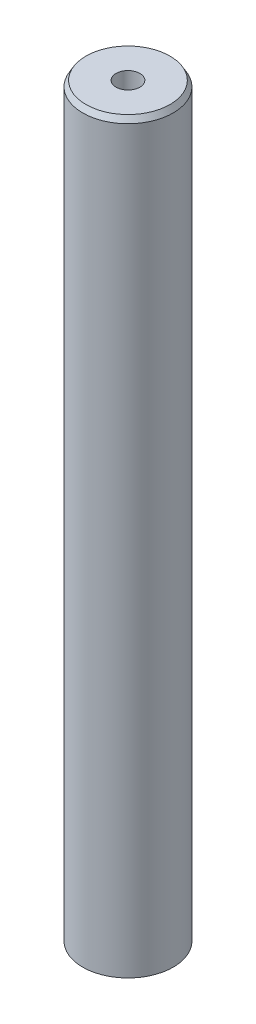
ISO-10303-21;
HEADER;
FILE_DESCRIPTION(('STEP AP214'),'2;1');
FILE_NAME('part.step','',(''),(''),'','','');
FILE_SCHEMA(('AUTOMOTIVE_DESIGN { 1 0 10303 214 1 1 1 1 }'));
ENDSEC;
DATA;
#1=APPLICATION_CONTEXT('core data for automotive mechanical design processes');
#2=APPLICATION_PROTOCOL_DEFINITION('international standard','automotive_design',2000,#1);
#3=PRODUCT_CONTEXT('',#1,'mechanical');
#4=PRODUCT('Part','Part','',(#3));
#5=PRODUCT_RELATED_PRODUCT_CATEGORY('part','',(#4));
#6=PRODUCT_DEFINITION_FORMATION('','',#4);
#7=PRODUCT_DEFINITION_CONTEXT('part definition',#1,'design');
#8=PRODUCT_DEFINITION('design','',#6,#7);
#9=PRODUCT_DEFINITION_SHAPE('','',#8);
#10=(LENGTH_UNIT() NAMED_UNIT(*) SI_UNIT(.MILLI.,.METRE.));
#11=(NAMED_UNIT(*) PLANE_ANGLE_UNIT() SI_UNIT($,.RADIAN.));
#12=(NAMED_UNIT(*) SI_UNIT($,.STERADIAN.) SOLID_ANGLE_UNIT());
#13=UNCERTAINTY_MEASURE_WITH_UNIT(LENGTH_MEASURE(1.E-05),#10,'distance_accuracy_value','');
#14=(GEOMETRIC_REPRESENTATION_CONTEXT(3) GLOBAL_UNCERTAINTY_ASSIGNED_CONTEXT((#13)) GLOBAL_UNIT_ASSIGNED_CONTEXT((#10,
#11,#12)) REPRESENTATION_CONTEXT('',''));
#15=CARTESIAN_POINT('',(0.,0.,0.));
#16=DIRECTION('',(0.,0.,1.));
#17=DIRECTION('',(1.,0.,0.));
#18=AXIS2_PLACEMENT_3D('',#15,#16,#17);
#19=CARTESIAN_POINT('',(0.,124.066771420868,0.));
#20=DIRECTION('',(0.,-1.,0.));
#21=DIRECTION('',(0.,0.,-1.));
#22=AXIS2_PLACEMENT_3D('',#19,#20,#21);
#23=CYLINDRICAL_SURFACE('',#22,7.5);
#24=CARTESIAN_POINT('',(0.,123.131440600591,0.));
#25=DIRECTION('',(0.,1.,0.));
#26=DIRECTION('',(0.,0.,1.));
#27=AXIS2_PLACEMENT_3D('',#24,#25,#26);
#28=CIRCLE('',#27,7.5);
#29=CARTESIAN_POINT('',(0.,123.131440600591,7.5));
#30=VERTEX_POINT('',#29);
#31=EDGE_CURVE('E50',#30,#30,#28,.F.);
#32=ORIENTED_EDGE('',*,*,#31,.T.);
#33=EDGE_LOOP('',(#32));
#34=FACE_BOUND('',#33,.T.);
#35=CARTESIAN_POINT('',(0.,0.540013500868686,0.));
#36=DIRECTION('',(0.,1.,0.));
#37=DIRECTION('',(0.,0.,1.));
#38=AXIS2_PLACEMENT_3D('',#35,#36,#37);
#39=CIRCLE('',#38,7.5);
#40=CARTESIAN_POINT('',(0.,0.540013500868686,7.5));
#41=VERTEX_POINT('',#40);
#42=EDGE_CURVE('E51',#41,#41,#39,.T.);
#43=ORIENTED_EDGE('',*,*,#42,.T.);
#44=EDGE_LOOP('',(#43));
#45=FACE_BOUND('',#44,.T.);
#46=ADVANCED_FACE('F39',(#34,#45),#23,.T.);
#47=CARTESIAN_POINT('',(0.,124.066771420868,0.));
#48=DIRECTION('',(0.,1.,0.));
#49=DIRECTION('',(0.,0.,1.));
#50=AXIS2_PLACEMENT_3D('',#47,#48,#49);
#51=PLANE('',#50);
#52=CARTESIAN_POINT('',(0.,124.066771420868,0.));
#53=DIRECTION('',(0.,1.,0.));
#54=DIRECTION('',(0.,0.,1.));
#55=AXIS2_PLACEMENT_3D('',#52,#53,#54);
#56=CIRCLE('',#55,6.95998649913134);
#57=CARTESIAN_POINT('',(0.,124.066771420868,6.95998649913134));
#58=VERTEX_POINT('',#57);
#59=EDGE_CURVE('E54',#58,#58,#56,.T.);
#60=ORIENTED_EDGE('',*,*,#59,.T.);
#61=EDGE_LOOP('',(#60));
#62=FACE_BOUND('',#61,.T.);
#63=CARTESIAN_POINT('',(0.,124.066771420868,0.));
#64=DIRECTION('',(0.,1.,0.));
#65=DIRECTION('',(0.,0.,1.));
#66=AXIS2_PLACEMENT_3D('',#63,#64,#65);
#67=CIRCLE('',#66,1.97859664832348);
#68=CARTESIAN_POINT('',(0.,124.066771420868,1.97859664832348));
#69=VERTEX_POINT('',#68);
#70=EDGE_CURVE('E58',#69,#69,#67,.T.);
#71=ORIENTED_EDGE('',*,*,#70,.F.);
#72=EDGE_LOOP('',(#71));
#73=FACE_BOUND('',#72,.T.);
#74=ADVANCED_FACE('F69',(#62,#73),#51,.T.);
#75=CARTESIAN_POINT('',(0.,0.,0.));
#76=DIRECTION('',(0.,1.,0.));
#77=DIRECTION('',(0.,0.,1.));
#78=AXIS2_PLACEMENT_3D('',#75,#76,#77);
#79=PLANE('',#78);
#80=CARTESIAN_POINT('',(0.,0.,0.));
#81=DIRECTION('',(0.,1.,0.));
#82=DIRECTION('',(0.,0.,1.));
#83=AXIS2_PLACEMENT_3D('',#80,#81,#82);
#84=CIRCLE('',#83,6.56466917972229);
#85=CARTESIAN_POINT('',(0.,0.,6.56466917972229));
#86=VERTEX_POINT('',#85);
#87=EDGE_CURVE('E10',#86,#86,#84,.F.);
#88=ORIENTED_EDGE('',*,*,#87,.T.);
#89=EDGE_LOOP('',(#88));
#90=FACE_BOUND('',#89,.T.);
#91=CARTESIAN_POINT('',(0.,0.,0.));
#92=DIRECTION('',(0.,1.,0.));
#93=DIRECTION('',(0.,0.,1.));
#94=AXIS2_PLACEMENT_3D('',#91,#92,#93);
#95=CIRCLE('',#94,1.97859664832348);
#96=CARTESIAN_POINT('',(0.,0.,1.97859664832348));
#97=VERTEX_POINT('',#96);
#98=EDGE_CURVE('E63',#97,#97,#95,.T.);
#99=ORIENTED_EDGE('',*,*,#98,.T.);
#100=EDGE_LOOP('',(#99));
#101=FACE_BOUND('',#100,.T.);
#102=ADVANCED_FACE('F75',(#90,#101),#79,.F.);
#103=CARTESIAN_POINT('',(0.,124.066771420868,0.));
#104=DIRECTION('',(0.,-1.,0.));
#105=DIRECTION('',(0.,0.,-1.));
#106=AXIS2_PLACEMENT_3D('',#103,#104,#105);
#107=CYLINDRICAL_SURFACE('',#106,1.97859664832348);
#108=ORIENTED_EDGE('',*,*,#70,.T.);
#109=EDGE_LOOP('',(#108));
#110=FACE_BOUND('',#109,.T.);
#111=ORIENTED_EDGE('',*,*,#98,.F.);
#112=EDGE_LOOP('',(#111));
#113=FACE_BOUND('',#112,.T.);
#114=ADVANCED_FACE('F70',(#110,#113),#107,.F.);
#115=CARTESIAN_POINT('',(0.,124.066771420868,0.));
#116=DIRECTION('',(0.,-1.,0.));
#117=DIRECTION('',(0.,0.,-1.));
#118=AXIS2_PLACEMENT_3D('',#115,#116,#117);
#119=CONICAL_SURFACE('',#118,6.95998649913134,0.523598775598288);
#120=ORIENTED_EDGE('',*,*,#31,.F.);
#121=EDGE_LOOP('',(#120));
#122=FACE_BOUND('',#121,.T.);
#123=ORIENTED_EDGE('',*,*,#59,.F.);
#124=EDGE_LOOP('',(#123));
#125=FACE_BOUND('',#124,.T.);
#126=ADVANCED_FACE('F81',(#122,#125),#119,.T.);
#127=CARTESIAN_POINT('',(0.,0.540013500868686,0.));
#128=DIRECTION('',(0.,1.,0.));
#129=DIRECTION('',(0.,0.,1.));
#130=AXIS2_PLACEMENT_3D('',#127,#128,#129);
#131=CONICAL_SURFACE('',#130,7.5,1.0471975511966);
#132=ORIENTED_EDGE('',*,*,#87,.F.);
#133=EDGE_LOOP('',(#132));
#134=FACE_BOUND('',#133,.T.);
#135=ORIENTED_EDGE('',*,*,#42,.F.);
#136=EDGE_LOOP('',(#135));
#137=FACE_BOUND('',#136,.T.);
#138=ADVANCED_FACE('F45',(#134,#137),#131,.T.);
#139=CLOSED_SHELL('',(#46,#74,#102,#114,#126,#138));
#140=MANIFOLD_SOLID_BREP('B2',#139);
#141=ADVANCED_BREP_SHAPE_REPRESENTATION('',(#18,#140),#14);
#142=SHAPE_DEFINITION_REPRESENTATION(#9,#141);
ENDSEC;
END-ISO-10303-21;
